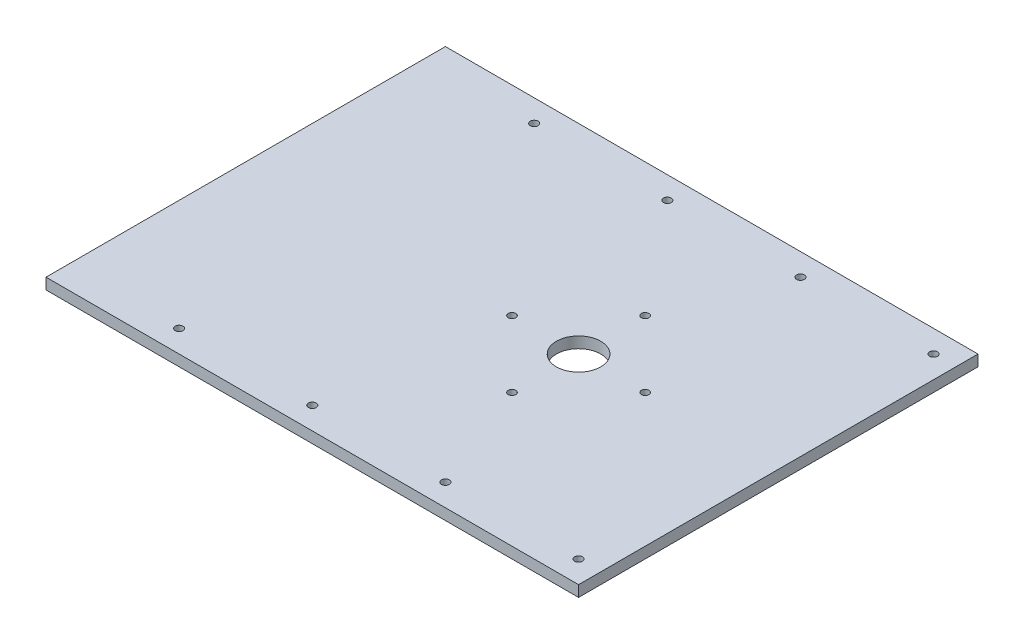
ISO-10303-21;
HEADER;
FILE_DESCRIPTION(('STEP AP214'),'2;1');
FILE_NAME('part.step','',(''),(''),'','','');
FILE_SCHEMA(('AUTOMOTIVE_DESIGN { 1 0 10303 214 1 1 1 1 }'));
ENDSEC;
DATA;
#1=APPLICATION_CONTEXT('core data for automotive mechanical design processes');
#2=APPLICATION_PROTOCOL_DEFINITION('international standard','automotive_design',2000,#1);
#3=PRODUCT_CONTEXT('',#1,'mechanical');
#4=PRODUCT('Part','Part','',(#3));
#5=PRODUCT_RELATED_PRODUCT_CATEGORY('part','',(#4));
#6=PRODUCT_DEFINITION_FORMATION('','',#4);
#7=PRODUCT_DEFINITION_CONTEXT('part definition',#1,'design');
#8=PRODUCT_DEFINITION('design','',#6,#7);
#9=PRODUCT_DEFINITION_SHAPE('','',#8);
#10=(LENGTH_UNIT() NAMED_UNIT(*) SI_UNIT(.MILLI.,.METRE.));
#11=(NAMED_UNIT(*) PLANE_ANGLE_UNIT() SI_UNIT($,.RADIAN.));
#12=(NAMED_UNIT(*) SI_UNIT($,.STERADIAN.) SOLID_ANGLE_UNIT());
#13=UNCERTAINTY_MEASURE_WITH_UNIT(LENGTH_MEASURE(1.E-05),#10,'distance_accuracy_value','');
#14=(GEOMETRIC_REPRESENTATION_CONTEXT(3) GLOBAL_UNCERTAINTY_ASSIGNED_CONTEXT((#13)) GLOBAL_UNIT_ASSIGNED_CONTEXT((#10,
#11,#12)) REPRESENTATION_CONTEXT('',''));
#15=CARTESIAN_POINT('',(0.,0.,0.));
#16=DIRECTION('',(0.,0.,1.));
#17=DIRECTION('',(1.,0.,0.));
#18=AXIS2_PLACEMENT_3D('',#15,#16,#17);
#19=CARTESIAN_POINT('',(0.,6.35,0.));
#20=DIRECTION('',(-1.,0.,0.));
#21=DIRECTION('',(0.,0.,1.));
#22=AXIS2_PLACEMENT_3D('',#19,#20,#21);
#23=PLANE('',#22);
#24=DIRECTION('',(0.,0.,-1.));
#25=VECTOR('',#24,1.);
#26=CARTESIAN_POINT('',(0.,0.,0.));
#27=LINE('',#26,#25);
#28=CARTESIAN_POINT('',(0.,0.,0.));
#29=VERTEX_POINT('',#28);
#30=CARTESIAN_POINT('',(0.,0.,-228.6));
#31=VERTEX_POINT('',#30);
#32=EDGE_CURVE('E100',#29,#31,#27,.T.);
#33=ORIENTED_EDGE('',*,*,#32,.T.);
#34=DIRECTION('',(0.,-1.,0.));
#35=VECTOR('',#34,1.);
#36=CARTESIAN_POINT('',(0.,6.35,-228.6));
#37=LINE('',#36,#35);
#38=CARTESIAN_POINT('',(0.,6.35,-228.6));
#39=VERTEX_POINT('',#38);
#40=EDGE_CURVE('E91',#39,#31,#37,.T.);
#41=ORIENTED_EDGE('',*,*,#40,.F.);
#42=DIRECTION('',(0.,0.,-1.));
#43=VECTOR('',#42,1.);
#44=CARTESIAN_POINT('',(0.,6.35,0.));
#45=LINE('',#44,#43);
#46=CARTESIAN_POINT('',(0.,6.35,0.));
#47=VERTEX_POINT('',#46);
#48=EDGE_CURVE('E85',#47,#39,#45,.T.);
#49=ORIENTED_EDGE('',*,*,#48,.F.);
#50=DIRECTION('',(0.,-1.,0.));
#51=VECTOR('',#50,1.);
#52=CARTESIAN_POINT('',(0.,6.35,0.));
#53=LINE('',#52,#51);
#54=EDGE_CURVE('E96',#47,#29,#53,.T.);
#55=ORIENTED_EDGE('',*,*,#54,.T.);
#56=EDGE_LOOP('',(#33,#41,#49,#55));
#57=FACE_BOUND('',#56,.T.);
#58=ADVANCED_FACE('F31',(#57),#23,.F.);
#59=CARTESIAN_POINT('',(0.,6.35,-228.6));
#60=DIRECTION('',(0.,0.,1.));
#61=DIRECTION('',(1.,0.,0.));
#62=AXIS2_PLACEMENT_3D('',#59,#60,#61);
#63=PLANE('',#62);
#64=DIRECTION('',(-1.,0.,0.));
#65=VECTOR('',#64,1.);
#66=CARTESIAN_POINT('',(0.,0.,-228.6));
#67=LINE('',#66,#65);
#68=CARTESIAN_POINT('',(-304.8,0.,-228.6));
#69=VERTEX_POINT('',#68);
#70=EDGE_CURVE('E90',#31,#69,#67,.T.);
#71=ORIENTED_EDGE('',*,*,#70,.T.);
#72=DIRECTION('',(0.,-1.,0.));
#73=VECTOR('',#72,1.);
#74=CARTESIAN_POINT('',(-304.8,6.35,-228.6));
#75=LINE('',#74,#73);
#76=CARTESIAN_POINT('',(-304.8,6.35,-228.6));
#77=VERTEX_POINT('',#76);
#78=EDGE_CURVE('E88',#77,#69,#75,.T.);
#79=ORIENTED_EDGE('',*,*,#78,.F.);
#80=DIRECTION('',(-1.,0.,0.));
#81=VECTOR('',#80,1.);
#82=CARTESIAN_POINT('',(0.,6.35,-228.6));
#83=LINE('',#82,#81);
#84=EDGE_CURVE('E79',#39,#77,#83,.T.);
#85=ORIENTED_EDGE('',*,*,#84,.F.);
#86=ORIENTED_EDGE('',*,*,#40,.T.);
#87=EDGE_LOOP('',(#71,#79,#85,#86));
#88=FACE_BOUND('',#87,.T.);
#89=ADVANCED_FACE('F89',(#88),#63,.F.);
#90=CARTESIAN_POINT('',(-304.8,6.35,0.));
#91=DIRECTION('',(1.,0.,0.));
#92=DIRECTION('',(0.,0.,-1.));
#93=AXIS2_PLACEMENT_3D('',#90,#91,#92);
#94=PLANE('',#93);
#95=DIRECTION('',(0.,0.,1.));
#96=VECTOR('',#95,1.);
#97=CARTESIAN_POINT('',(-304.8,0.,0.));
#98=LINE('',#97,#96);
#99=CARTESIAN_POINT('',(-304.8,0.,0.));
#100=VERTEX_POINT('',#99);
#101=EDGE_CURVE('E65',#69,#100,#98,.T.);
#102=ORIENTED_EDGE('',*,*,#101,.T.);
#103=DIRECTION('',(0.,-1.,0.));
#104=VECTOR('',#103,1.);
#105=CARTESIAN_POINT('',(-304.8,6.35,0.));
#106=LINE('',#105,#104);
#107=CARTESIAN_POINT('',(-304.8,6.35,0.));
#108=VERTEX_POINT('',#107);
#109=EDGE_CURVE('E92',#108,#100,#106,.T.);
#110=ORIENTED_EDGE('',*,*,#109,.F.);
#111=DIRECTION('',(0.,0.,1.));
#112=VECTOR('',#111,1.);
#113=CARTESIAN_POINT('',(-304.8,6.35,0.));
#114=LINE('',#113,#112);
#115=EDGE_CURVE('E83',#77,#108,#114,.T.);
#116=ORIENTED_EDGE('',*,*,#115,.F.);
#117=ORIENTED_EDGE('',*,*,#78,.T.);
#118=EDGE_LOOP('',(#102,#110,#116,#117));
#119=FACE_BOUND('',#118,.T.);
#120=ADVANCED_FACE('F94',(#119),#94,.F.);
#121=CARTESIAN_POINT('',(0.,6.35,0.));
#122=DIRECTION('',(0.,0.,-1.));
#123=DIRECTION('',(-1.,0.,0.));
#124=AXIS2_PLACEMENT_3D('',#121,#122,#123);
#125=PLANE('',#124);
#126=DIRECTION('',(1.,0.,0.));
#127=VECTOR('',#126,1.);
#128=CARTESIAN_POINT('',(0.,0.,0.));
#129=LINE('',#128,#127);
#130=EDGE_CURVE('E71',#100,#29,#129,.T.);
#131=ORIENTED_EDGE('',*,*,#130,.T.);
#132=ORIENTED_EDGE('',*,*,#54,.F.);
#133=DIRECTION('',(1.,0.,0.));
#134=VECTOR('',#133,1.);
#135=CARTESIAN_POINT('',(0.,6.35,0.));
#136=LINE('',#135,#134);
#137=EDGE_CURVE('E48',#108,#47,#136,.T.);
#138=ORIENTED_EDGE('',*,*,#137,.F.);
#139=ORIENTED_EDGE('',*,*,#109,.T.);
#140=EDGE_LOOP('',(#131,#132,#138,#139));
#141=FACE_BOUND('',#140,.T.);
#142=ADVANCED_FACE('F166',(#141),#125,.F.);
#143=CARTESIAN_POINT('',(0.,6.35,-228.6));
#144=DIRECTION('',(0.,1.,0.));
#145=DIRECTION('',(0.,0.,1.));
#146=AXIS2_PLACEMENT_3D('',#143,#144,#145);
#147=PLANE('',#146);
#148=CARTESIAN_POINT('',(-88.9,6.35,-215.9));
#149=DIRECTION('',(0.,-1.,0.));
#150=DIRECTION('',(0.,0.,-1.));
#151=AXIS2_PLACEMENT_3D('',#148,#149,#150);
#152=CIRCLE('',#151,2.2479);
#153=CARTESIAN_POINT('',(-88.9,6.35,-218.1479));
#154=VERTEX_POINT('',#153);
#155=EDGE_CURVE('E355',#154,#154,#152,.T.);
#156=ORIENTED_EDGE('',*,*,#155,.T.);
#157=EDGE_LOOP('',(#156));
#158=FACE_BOUND('',#157,.T.);
#159=CARTESIAN_POINT('',(-88.9,6.35,-12.7));
#160=DIRECTION('',(0.,-1.,0.));
#161=DIRECTION('',(0.,0.,-1.));
#162=AXIS2_PLACEMENT_3D('',#159,#160,#161);
#163=CIRCLE('',#162,2.2479);
#164=CARTESIAN_POINT('',(-88.9,6.35,-14.9479));
#165=VERTEX_POINT('',#164);
#166=EDGE_CURVE('E346',#165,#165,#163,.T.);
#167=ORIENTED_EDGE('',*,*,#166,.T.);
#168=EDGE_LOOP('',(#167));
#169=FACE_BOUND('',#168,.T.);
#170=CARTESIAN_POINT('',(-12.7,6.35,-12.7));
#171=DIRECTION('',(0.,-1.,0.));
#172=DIRECTION('',(0.,0.,-1.));
#173=AXIS2_PLACEMENT_3D('',#170,#171,#172);
#174=CIRCLE('',#173,2.2479);
#175=CARTESIAN_POINT('',(-12.7,6.35,-14.9479));
#176=VERTEX_POINT('',#175);
#177=EDGE_CURVE('E334',#176,#176,#174,.T.);
#178=ORIENTED_EDGE('',*,*,#177,.T.);
#179=EDGE_LOOP('',(#178));
#180=FACE_BOUND('',#179,.T.);
#181=CARTESIAN_POINT('',(-12.7,6.35,-215.9));
#182=DIRECTION('',(0.,-1.,0.));
#183=DIRECTION('',(0.,0.,-1.));
#184=AXIS2_PLACEMENT_3D('',#181,#182,#183);
#185=CIRCLE('',#184,2.2479);
#186=CARTESIAN_POINT('',(-12.7,6.35,-218.1479));
#187=VERTEX_POINT('',#186);
#188=EDGE_CURVE('E323',#187,#187,#185,.T.);
#189=ORIENTED_EDGE('',*,*,#188,.T.);
#190=EDGE_LOOP('',(#189));
#191=FACE_BOUND('',#190,.T.);
#192=CARTESIAN_POINT('',(-114.3,6.35,-114.3));
#193=DIRECTION('',(0.,1.,0.));
#194=DIRECTION('',(0.,0.,1.));
#195=AXIS2_PLACEMENT_3D('',#192,#193,#194);
#196=CIRCLE('',#195,12.7);
#197=CARTESIAN_POINT('',(-114.3,6.35,-101.6));
#198=VERTEX_POINT('',#197);
#199=EDGE_CURVE('E320',#198,#198,#196,.T.);
#200=ORIENTED_EDGE('',*,*,#199,.F.);
#201=EDGE_LOOP('',(#200));
#202=FACE_BOUND('',#201,.T.);
#203=CARTESIAN_POINT('',(-76.2,6.35,-114.3));
#204=DIRECTION('',(0.,-1.,0.));
#205=DIRECTION('',(0.,0.,-1.));
#206=AXIS2_PLACEMENT_3D('',#203,#204,#205);
#207=CIRCLE('',#206,2.15264999999999);
#208=CARTESIAN_POINT('',(-76.2,6.35,-116.45265));
#209=VERTEX_POINT('',#208);
#210=EDGE_CURVE('E310',#209,#209,#207,.T.);
#211=ORIENTED_EDGE('',*,*,#210,.T.);
#212=EDGE_LOOP('',(#211));
#213=FACE_BOUND('',#212,.T.);
#214=CARTESIAN_POINT('',(-114.3,6.35,-152.4));
#215=DIRECTION('',(0.,-1.,0.));
#216=DIRECTION('',(0.,0.,-1.));
#217=AXIS2_PLACEMENT_3D('',#214,#215,#216);
#218=CIRCLE('',#217,2.15264999999999);
#219=CARTESIAN_POINT('',(-114.3,6.35,-154.55265));
#220=VERTEX_POINT('',#219);
#221=EDGE_CURVE('E301',#220,#220,#218,.T.);
#222=ORIENTED_EDGE('',*,*,#221,.T.);
#223=EDGE_LOOP('',(#222));
#224=FACE_BOUND('',#223,.T.);
#225=CARTESIAN_POINT('',(-152.4,6.35,-114.3));
#226=DIRECTION('',(0.,-1.,0.));
#227=DIRECTION('',(0.,0.,-1.));
#228=AXIS2_PLACEMENT_3D('',#225,#226,#227);
#229=CIRCLE('',#228,2.15265000000001);
#230=CARTESIAN_POINT('',(-152.4,6.35,-116.45265));
#231=VERTEX_POINT('',#230);
#232=EDGE_CURVE('E284',#231,#231,#229,.T.);
#233=ORIENTED_EDGE('',*,*,#232,.T.);
#234=EDGE_LOOP('',(#233));
#235=FACE_BOUND('',#234,.T.);
#236=CARTESIAN_POINT('',(-114.3,6.35,-76.2));
#237=DIRECTION('',(0.,-1.,0.));
#238=DIRECTION('',(0.,0.,-1.));
#239=AXIS2_PLACEMENT_3D('',#236,#237,#238);
#240=CIRCLE('',#239,2.15264999999999);
#241=CARTESIAN_POINT('',(-114.3,6.35,-78.35265));
#242=VERTEX_POINT('',#241);
#243=EDGE_CURVE('E103',#242,#242,#240,.T.);
#244=ORIENTED_EDGE('',*,*,#243,.T.);
#245=EDGE_LOOP('',(#244));
#246=FACE_BOUND('',#245,.T.);
#247=ORIENTED_EDGE('',*,*,#48,.T.);
#248=ORIENTED_EDGE('',*,*,#84,.T.);
#249=ORIENTED_EDGE('',*,*,#115,.T.);
#250=ORIENTED_EDGE('',*,*,#137,.T.);
#251=EDGE_LOOP('',(#247,#248,#249,#250));
#252=FACE_BOUND('',#251,.T.);
#253=CARTESIAN_POINT('',(-165.1,6.35,-12.6999999999999));
#254=DIRECTION('',(0.,-1.,0.));
#255=DIRECTION('',(0.,0.,-1.));
#256=AXIS2_PLACEMENT_3D('',#253,#254,#255);
#257=CIRCLE('',#256,2.2479);
#258=CARTESIAN_POINT('',(-165.1,6.35,-14.9478999999999));
#259=VERTEX_POINT('',#258);
#260=EDGE_CURVE('E113',#259,#259,#257,.T.);
#261=ORIENTED_EDGE('',*,*,#260,.T.);
#262=EDGE_LOOP('',(#261));
#263=FACE_BOUND('',#262,.T.);
#264=CARTESIAN_POINT('',(-241.3,6.35,-12.6999999999999));
#265=DIRECTION('',(0.,-1.,0.));
#266=DIRECTION('',(0.,0.,-1.));
#267=AXIS2_PLACEMENT_3D('',#264,#265,#266);
#268=CIRCLE('',#267,2.2479);
#269=CARTESIAN_POINT('',(-241.3,6.35,-14.9478999999999));
#270=VERTEX_POINT('',#269);
#271=EDGE_CURVE('E122',#270,#270,#268,.T.);
#272=ORIENTED_EDGE('',*,*,#271,.T.);
#273=EDGE_LOOP('',(#272));
#274=FACE_BOUND('',#273,.T.);
#275=CARTESIAN_POINT('',(-165.1,6.35,-215.9));
#276=DIRECTION('',(0.,-1.,0.));
#277=DIRECTION('',(0.,0.,-1.));
#278=AXIS2_PLACEMENT_3D('',#275,#276,#277);
#279=CIRCLE('',#278,2.2479);
#280=CARTESIAN_POINT('',(-165.1,6.35,-218.1479));
#281=VERTEX_POINT('',#280);
#282=EDGE_CURVE('E131',#281,#281,#279,.T.);
#283=ORIENTED_EDGE('',*,*,#282,.T.);
#284=EDGE_LOOP('',(#283));
#285=FACE_BOUND('',#284,.T.);
#286=CARTESIAN_POINT('',(-241.3,6.35,-215.9));
#287=DIRECTION('',(0.,-1.,0.));
#288=DIRECTION('',(0.,0.,-1.));
#289=AXIS2_PLACEMENT_3D('',#286,#287,#288);
#290=CIRCLE('',#289,2.2479);
#291=CARTESIAN_POINT('',(-241.3,6.35,-218.1479));
#292=VERTEX_POINT('',#291);
#293=EDGE_CURVE('E40',#292,#292,#290,.T.);
#294=ORIENTED_EDGE('',*,*,#293,.T.);
#295=EDGE_LOOP('',(#294));
#296=FACE_BOUND('',#295,.T.);
#297=ADVANCED_FACE('F80',(#158,#169,#180,#191,#202,#213,#224,#235,#246,#252,#263,#274,#285,
#296),#147,.T.);
#298=CARTESIAN_POINT('',(0.,0.,-228.6));
#299=DIRECTION('',(0.,1.,0.));
#300=DIRECTION('',(0.,0.,1.));
#301=AXIS2_PLACEMENT_3D('',#298,#299,#300);
#302=PLANE('',#301);
#303=CARTESIAN_POINT('',(-88.9,0.,-215.9));
#304=DIRECTION('',(0.,-1.,0.));
#305=DIRECTION('',(0.,0.,-1.));
#306=AXIS2_PLACEMENT_3D('',#303,#304,#305);
#307=CIRCLE('',#306,4.2164);
#308=CARTESIAN_POINT('',(-88.9,0.,-220.1164));
#309=VERTEX_POINT('',#308);
#310=EDGE_CURVE('E358',#309,#309,#307,.T.);
#311=ORIENTED_EDGE('',*,*,#310,.F.);
#312=EDGE_LOOP('',(#311));
#313=FACE_BOUND('',#312,.T.);
#314=CARTESIAN_POINT('',(-88.9,0.,-12.7));
#315=DIRECTION('',(0.,-1.,0.));
#316=DIRECTION('',(0.,0.,-1.));
#317=AXIS2_PLACEMENT_3D('',#314,#315,#316);
#318=CIRCLE('',#317,4.2164);
#319=CARTESIAN_POINT('',(-88.9,0.,-16.9164));
#320=VERTEX_POINT('',#319);
#321=EDGE_CURVE('E349',#320,#320,#318,.T.);
#322=ORIENTED_EDGE('',*,*,#321,.F.);
#323=EDGE_LOOP('',(#322));
#324=FACE_BOUND('',#323,.T.);
#325=CARTESIAN_POINT('',(-12.7,0.,-12.7));
#326=DIRECTION('',(0.,-1.,0.));
#327=DIRECTION('',(0.,0.,-1.));
#328=AXIS2_PLACEMENT_3D('',#325,#326,#327);
#329=CIRCLE('',#328,4.2164);
#330=CARTESIAN_POINT('',(-12.7,0.,-16.9164));
#331=VERTEX_POINT('',#330);
#332=EDGE_CURVE('E340',#331,#331,#329,.T.);
#333=ORIENTED_EDGE('',*,*,#332,.F.);
#334=EDGE_LOOP('',(#333));
#335=FACE_BOUND('',#334,.T.);
#336=CARTESIAN_POINT('',(-12.7,0.,-215.9));
#337=DIRECTION('',(0.,-1.,0.));
#338=DIRECTION('',(0.,0.,-1.));
#339=AXIS2_PLACEMENT_3D('',#336,#337,#338);
#340=CIRCLE('',#339,4.2164);
#341=CARTESIAN_POINT('',(-12.7,0.,-220.1164));
#342=VERTEX_POINT('',#341);
#343=EDGE_CURVE('E331',#342,#342,#340,.T.);
#344=ORIENTED_EDGE('',*,*,#343,.F.);
#345=EDGE_LOOP('',(#344));
#346=FACE_BOUND('',#345,.T.);
#347=CARTESIAN_POINT('',(-114.3,0.,-114.3));
#348=DIRECTION('',(0.,1.,0.));
#349=DIRECTION('',(0.,0.,1.));
#350=AXIS2_PLACEMENT_3D('',#347,#348,#349);
#351=CIRCLE('',#350,12.7);
#352=CARTESIAN_POINT('',(-114.3,0.,-101.6));
#353=VERTEX_POINT('',#352);
#354=EDGE_CURVE('E319',#353,#353,#351,.T.);
#355=ORIENTED_EDGE('',*,*,#354,.T.);
#356=EDGE_LOOP('',(#355));
#357=FACE_BOUND('',#356,.T.);
#358=CARTESIAN_POINT('',(-76.2,0.,-114.3));
#359=DIRECTION('',(0.,-1.,0.));
#360=DIRECTION('',(0.,0.,-1.));
#361=AXIS2_PLACEMENT_3D('',#358,#359,#360);
#362=CIRCLE('',#361,4.21639999999999);
#363=CARTESIAN_POINT('',(-76.2,0.,-118.5164));
#364=VERTEX_POINT('',#363);
#365=EDGE_CURVE('E316',#364,#364,#362,.T.);
#366=ORIENTED_EDGE('',*,*,#365,.F.);
#367=EDGE_LOOP('',(#366));
#368=FACE_BOUND('',#367,.T.);
#369=CARTESIAN_POINT('',(-114.3,0.,-152.4));
#370=DIRECTION('',(0.,-1.,0.));
#371=DIRECTION('',(0.,0.,-1.));
#372=AXIS2_PLACEMENT_3D('',#369,#370,#371);
#373=CIRCLE('',#372,4.21639999999999);
#374=CARTESIAN_POINT('',(-114.3,0.,-156.6164));
#375=VERTEX_POINT('',#374);
#376=EDGE_CURVE('E307',#375,#375,#373,.T.);
#377=ORIENTED_EDGE('',*,*,#376,.F.);
#378=EDGE_LOOP('',(#377));
#379=FACE_BOUND('',#378,.T.);
#380=CARTESIAN_POINT('',(-152.4,0.,-114.3));
#381=DIRECTION('',(0.,-1.,0.));
#382=DIRECTION('',(0.,0.,-1.));
#383=AXIS2_PLACEMENT_3D('',#380,#381,#382);
#384=CIRCLE('',#383,4.21640000000001);
#385=CARTESIAN_POINT('',(-152.4,0.,-118.5164));
#386=VERTEX_POINT('',#385);
#387=EDGE_CURVE('E298',#386,#386,#384,.T.);
#388=ORIENTED_EDGE('',*,*,#387,.F.);
#389=EDGE_LOOP('',(#388));
#390=FACE_BOUND('',#389,.T.);
#391=CARTESIAN_POINT('',(-114.3,0.,-76.2));
#392=DIRECTION('',(0.,-1.,0.));
#393=DIRECTION('',(0.,0.,-1.));
#394=AXIS2_PLACEMENT_3D('',#391,#392,#393);
#395=CIRCLE('',#394,4.21639999999999);
#396=CARTESIAN_POINT('',(-114.3,0.,-80.4164));
#397=VERTEX_POINT('',#396);
#398=EDGE_CURVE('E282',#397,#397,#395,.T.);
#399=ORIENTED_EDGE('',*,*,#398,.F.);
#400=EDGE_LOOP('',(#399));
#401=FACE_BOUND('',#400,.T.);
#402=ORIENTED_EDGE('',*,*,#32,.F.);
#403=ORIENTED_EDGE('',*,*,#130,.F.);
#404=ORIENTED_EDGE('',*,*,#101,.F.);
#405=ORIENTED_EDGE('',*,*,#70,.F.);
#406=EDGE_LOOP('',(#402,#403,#404,#405));
#407=FACE_BOUND('',#406,.T.);
#408=CARTESIAN_POINT('',(-165.1,0.,-12.6999999999999));
#409=DIRECTION('',(0.,-1.,0.));
#410=DIRECTION('',(0.,0.,-1.));
#411=AXIS2_PLACEMENT_3D('',#408,#409,#410);
#412=CIRCLE('',#411,4.2164);
#413=CARTESIAN_POINT('',(-165.1,0.,-16.9163999999999));
#414=VERTEX_POINT('',#413);
#415=EDGE_CURVE('E110',#414,#414,#412,.T.);
#416=ORIENTED_EDGE('',*,*,#415,.F.);
#417=EDGE_LOOP('',(#416));
#418=FACE_BOUND('',#417,.T.);
#419=CARTESIAN_POINT('',(-241.3,0.,-12.6999999999999));
#420=DIRECTION('',(0.,-1.,0.));
#421=DIRECTION('',(0.,0.,-1.));
#422=AXIS2_PLACEMENT_3D('',#419,#420,#421);
#423=CIRCLE('',#422,4.2164);
#424=CARTESIAN_POINT('',(-241.3,0.,-16.9163999999999));
#425=VERTEX_POINT('',#424);
#426=EDGE_CURVE('E119',#425,#425,#423,.T.);
#427=ORIENTED_EDGE('',*,*,#426,.F.);
#428=EDGE_LOOP('',(#427));
#429=FACE_BOUND('',#428,.T.);
#430=CARTESIAN_POINT('',(-165.1,0.,-215.9));
#431=DIRECTION('',(0.,-1.,0.));
#432=DIRECTION('',(0.,0.,-1.));
#433=AXIS2_PLACEMENT_3D('',#430,#431,#432);
#434=CIRCLE('',#433,4.2164);
#435=CARTESIAN_POINT('',(-165.1,0.,-220.1164));
#436=VERTEX_POINT('',#435);
#437=EDGE_CURVE('E128',#436,#436,#434,.T.);
#438=ORIENTED_EDGE('',*,*,#437,.F.);
#439=EDGE_LOOP('',(#438));
#440=FACE_BOUND('',#439,.T.);
#441=CARTESIAN_POINT('',(-241.3,0.,-215.9));
#442=DIRECTION('',(0.,-1.,0.));
#443=DIRECTION('',(0.,0.,-1.));
#444=AXIS2_PLACEMENT_3D('',#441,#442,#443);
#445=CIRCLE('',#444,4.2164);
#446=CARTESIAN_POINT('',(-241.3,0.,-220.1164));
#447=VERTEX_POINT('',#446);
#448=EDGE_CURVE('E137',#447,#447,#445,.T.);
#449=ORIENTED_EDGE('',*,*,#448,.F.);
#450=EDGE_LOOP('',(#449));
#451=FACE_BOUND('',#450,.T.);
#452=ADVANCED_FACE('F153',(#313,#324,#335,#346,#357,#368,#379,#390,#401,#407,#418,#429,#440,
#451),#302,.F.);
#453=CARTESIAN_POINT('',(-114.3,0.,-76.2));
#454=DIRECTION('',(0.,-1.,0.));
#455=DIRECTION('',(0.,0.,-1.));
#456=AXIS2_PLACEMENT_3D('',#453,#454,#455);
#457=CYLINDRICAL_SURFACE('',#456,2.15264999999999);
#458=ORIENTED_EDGE('',*,*,#243,.F.);
#459=EDGE_LOOP('',(#458));
#460=FACE_BOUND('',#459,.T.);
#461=CARTESIAN_POINT('',(-114.3,1.7316918638421,-76.2));
#462=DIRECTION('',(0.,-1.,0.));
#463=DIRECTION('',(0.,0.,-1.));
#464=AXIS2_PLACEMENT_3D('',#461,#462,#463);
#465=CIRCLE('',#464,2.15264999999999);
#466=CARTESIAN_POINT('',(-114.3,1.7316918638421,-78.35265));
#467=VERTEX_POINT('',#466);
#468=EDGE_CURVE('E279',#467,#467,#465,.T.);
#469=ORIENTED_EDGE('',*,*,#468,.T.);
#470=EDGE_LOOP('',(#469));
#471=FACE_BOUND('',#470,.T.);
#472=ADVANCED_FACE('F155',(#460,#471),#457,.F.);
#473=CARTESIAN_POINT('',(-114.3,0.,-76.2));
#474=DIRECTION('',(0.,-1.,0.));
#475=DIRECTION('',(0.,0.,-1.));
#476=AXIS2_PLACEMENT_3D('',#473,#474,#475);
#477=CONICAL_SURFACE('',#476,4.21639999999999,0.872664625997168);
#478=ORIENTED_EDGE('',*,*,#468,.F.);
#479=EDGE_LOOP('',(#478));
#480=FACE_BOUND('',#479,.T.);
#481=ORIENTED_EDGE('',*,*,#398,.T.);
#482=EDGE_LOOP('',(#481));
#483=FACE_BOUND('',#482,.T.);
#484=ADVANCED_FACE('F163',(#480,#483),#477,.F.);
#485=CARTESIAN_POINT('',(-152.4,0.,-114.3));
#486=DIRECTION('',(0.,-1.,0.));
#487=DIRECTION('',(0.,0.,-1.));
#488=AXIS2_PLACEMENT_3D('',#485,#486,#487);
#489=CYLINDRICAL_SURFACE('',#488,2.15264999999999);
#490=ORIENTED_EDGE('',*,*,#232,.F.);
#491=EDGE_LOOP('',(#490));
#492=FACE_BOUND('',#491,.T.);
#493=CARTESIAN_POINT('',(-152.4,1.7316918638421,-114.3));
#494=DIRECTION('',(0.,-1.,0.));
#495=DIRECTION('',(0.,0.,-1.));
#496=AXIS2_PLACEMENT_3D('',#493,#494,#495);
#497=CIRCLE('',#496,2.15264999999998);
#498=CARTESIAN_POINT('',(-152.4,1.7316918638421,-116.45265));
#499=VERTEX_POINT('',#498);
#500=EDGE_CURVE('E288',#499,#499,#497,.T.);
#501=ORIENTED_EDGE('',*,*,#500,.T.);
#502=EDGE_LOOP('',(#501));
#503=FACE_BOUND('',#502,.T.);
#504=ADVANCED_FACE('F267',(#492,#503),#489,.F.);
#505=CARTESIAN_POINT('',(-152.4,0.,-114.3));
#506=DIRECTION('',(0.,-1.,0.));
#507=DIRECTION('',(0.,0.,-1.));
#508=AXIS2_PLACEMENT_3D('',#505,#506,#507);
#509=CONICAL_SURFACE('',#508,4.21640000000001,0.872664625997174);
#510=ORIENTED_EDGE('',*,*,#500,.F.);
#511=EDGE_LOOP('',(#510));
#512=FACE_BOUND('',#511,.T.);
#513=ORIENTED_EDGE('',*,*,#387,.T.);
#514=EDGE_LOOP('',(#513));
#515=FACE_BOUND('',#514,.T.);
#516=ADVANCED_FACE('F263',(#512,#515),#509,.F.);
#517=CARTESIAN_POINT('',(-114.3,0.,-152.4));
#518=DIRECTION('',(0.,-1.,0.));
#519=DIRECTION('',(0.,0.,-1.));
#520=AXIS2_PLACEMENT_3D('',#517,#518,#519);
#521=CYLINDRICAL_SURFACE('',#520,2.15264999999999);
#522=ORIENTED_EDGE('',*,*,#221,.F.);
#523=EDGE_LOOP('',(#522));
#524=FACE_BOUND('',#523,.T.);
#525=CARTESIAN_POINT('',(-114.3,1.7316918638421,-152.4));
#526=DIRECTION('',(0.,-1.,0.));
#527=DIRECTION('',(0.,0.,-1.));
#528=AXIS2_PLACEMENT_3D('',#525,#526,#527);
#529=CIRCLE('',#528,2.15264999999999);
#530=CARTESIAN_POINT('',(-114.3,1.7316918638421,-154.55265));
#531=VERTEX_POINT('',#530);
#532=EDGE_CURVE('E304',#531,#531,#529,.T.);
#533=ORIENTED_EDGE('',*,*,#532,.T.);
#534=EDGE_LOOP('',(#533));
#535=FACE_BOUND('',#534,.T.);
#536=ADVANCED_FACE('F259',(#524,#535),#521,.F.);
#537=CARTESIAN_POINT('',(-114.3,0.,-152.4));
#538=DIRECTION('',(0.,-1.,0.));
#539=DIRECTION('',(0.,0.,-1.));
#540=AXIS2_PLACEMENT_3D('',#537,#538,#539);
#541=CONICAL_SURFACE('',#540,4.21639999999999,0.872664625997168);
#542=ORIENTED_EDGE('',*,*,#532,.F.);
#543=EDGE_LOOP('',(#542));
#544=FACE_BOUND('',#543,.T.);
#545=ORIENTED_EDGE('',*,*,#376,.T.);
#546=EDGE_LOOP('',(#545));
#547=FACE_BOUND('',#546,.T.);
#548=ADVANCED_FACE('F255',(#544,#547),#541,.F.);
#549=CARTESIAN_POINT('',(-76.2,0.,-114.3));
#550=DIRECTION('',(0.,-1.,0.));
#551=DIRECTION('',(0.,0.,-1.));
#552=AXIS2_PLACEMENT_3D('',#549,#550,#551);
#553=CYLINDRICAL_SURFACE('',#552,2.15264999999999);
#554=ORIENTED_EDGE('',*,*,#210,.F.);
#555=EDGE_LOOP('',(#554));
#556=FACE_BOUND('',#555,.T.);
#557=CARTESIAN_POINT('',(-76.2,1.7316918638421,-114.3));
#558=DIRECTION('',(0.,-1.,0.));
#559=DIRECTION('',(0.,0.,-1.));
#560=AXIS2_PLACEMENT_3D('',#557,#558,#559);
#561=CIRCLE('',#560,2.15264999999999);
#562=CARTESIAN_POINT('',(-76.2,1.7316918638421,-116.45265));
#563=VERTEX_POINT('',#562);
#564=EDGE_CURVE('E313',#563,#563,#561,.T.);
#565=ORIENTED_EDGE('',*,*,#564,.T.);
#566=EDGE_LOOP('',(#565));
#567=FACE_BOUND('',#566,.T.);
#568=ADVANCED_FACE('F251',(#556,#567),#553,.F.);
#569=CARTESIAN_POINT('',(-76.2,0.,-114.3));
#570=DIRECTION('',(0.,-1.,0.));
#571=DIRECTION('',(0.,0.,-1.));
#572=AXIS2_PLACEMENT_3D('',#569,#570,#571);
#573=CONICAL_SURFACE('',#572,4.21639999999999,0.872664625997168);
#574=ORIENTED_EDGE('',*,*,#564,.F.);
#575=EDGE_LOOP('',(#574));
#576=FACE_BOUND('',#575,.T.);
#577=ORIENTED_EDGE('',*,*,#365,.T.);
#578=EDGE_LOOP('',(#577));
#579=FACE_BOUND('',#578,.T.);
#580=ADVANCED_FACE('F247',(#576,#579),#573,.F.);
#581=CARTESIAN_POINT('',(-114.3,0.,-114.3));
#582=DIRECTION('',(0.,1.,0.));
#583=DIRECTION('',(0.,0.,1.));
#584=AXIS2_PLACEMENT_3D('',#581,#582,#583);
#585=CYLINDRICAL_SURFACE('',#584,12.7);
#586=ORIENTED_EDGE('',*,*,#354,.F.);
#587=EDGE_LOOP('',(#586));
#588=FACE_BOUND('',#587,.T.);
#589=ORIENTED_EDGE('',*,*,#199,.T.);
#590=EDGE_LOOP('',(#589));
#591=FACE_BOUND('',#590,.T.);
#592=ADVANCED_FACE('F243',(#588,#591),#585,.F.);
#593=CARTESIAN_POINT('',(-12.7,0.,-215.9));
#594=DIRECTION('',(0.,-1.,0.));
#595=DIRECTION('',(0.,0.,-1.));
#596=AXIS2_PLACEMENT_3D('',#593,#594,#595);
#597=CYLINDRICAL_SURFACE('',#596,2.2479);
#598=ORIENTED_EDGE('',*,*,#188,.F.);
#599=EDGE_LOOP('',(#598));
#600=FACE_BOUND('',#599,.T.);
#601=CARTESIAN_POINT('',(-12.7,1.65176762397248,-215.9));
#602=DIRECTION('',(0.,-1.,0.));
#603=DIRECTION('',(0.,0.,-1.));
#604=AXIS2_PLACEMENT_3D('',#601,#602,#603);
#605=CIRCLE('',#604,2.2479);
#606=CARTESIAN_POINT('',(-12.7,1.65176762397248,-218.1479));
#607=VERTEX_POINT('',#606);
#608=EDGE_CURVE('E328',#607,#607,#605,.T.);
#609=ORIENTED_EDGE('',*,*,#608,.T.);
#610=EDGE_LOOP('',(#609));
#611=FACE_BOUND('',#610,.T.);
#612=ADVANCED_FACE('F239',(#600,#611),#597,.F.);
#613=CARTESIAN_POINT('',(-12.7,0.,-215.9));
#614=DIRECTION('',(0.,-1.,0.));
#615=DIRECTION('',(0.,0.,-1.));
#616=AXIS2_PLACEMENT_3D('',#613,#614,#615);
#617=CONICAL_SURFACE('',#616,4.2164,0.872664625997165);
#618=ORIENTED_EDGE('',*,*,#608,.F.);
#619=EDGE_LOOP('',(#618));
#620=FACE_BOUND('',#619,.T.);
#621=ORIENTED_EDGE('',*,*,#343,.T.);
#622=EDGE_LOOP('',(#621));
#623=FACE_BOUND('',#622,.T.);
#624=ADVANCED_FACE('F235',(#620,#623),#617,.F.);
#625=CARTESIAN_POINT('',(-12.7,0.,-12.7));
#626=DIRECTION('',(0.,-1.,0.));
#627=DIRECTION('',(0.,0.,-1.));
#628=AXIS2_PLACEMENT_3D('',#625,#626,#627);
#629=CYLINDRICAL_SURFACE('',#628,2.2479);
#630=ORIENTED_EDGE('',*,*,#177,.F.);
#631=EDGE_LOOP('',(#630));
#632=FACE_BOUND('',#631,.T.);
#633=CARTESIAN_POINT('',(-12.7,1.65176762397248,-12.7));
#634=DIRECTION('',(0.,-1.,0.));
#635=DIRECTION('',(0.,0.,-1.));
#636=AXIS2_PLACEMENT_3D('',#633,#634,#635);
#637=CIRCLE('',#636,2.2479);
#638=CARTESIAN_POINT('',(-12.7,1.65176762397248,-14.9479));
#639=VERTEX_POINT('',#638);
#640=EDGE_CURVE('E337',#639,#639,#637,.T.);
#641=ORIENTED_EDGE('',*,*,#640,.T.);
#642=EDGE_LOOP('',(#641));
#643=FACE_BOUND('',#642,.T.);
#644=ADVANCED_FACE('F231',(#632,#643),#629,.F.);
#645=CARTESIAN_POINT('',(-12.7,0.,-12.7));
#646=DIRECTION('',(0.,-1.,0.));
#647=DIRECTION('',(0.,0.,-1.));
#648=AXIS2_PLACEMENT_3D('',#645,#646,#647);
#649=CONICAL_SURFACE('',#648,4.2164,0.872664625997165);
#650=ORIENTED_EDGE('',*,*,#640,.F.);
#651=EDGE_LOOP('',(#650));
#652=FACE_BOUND('',#651,.T.);
#653=ORIENTED_EDGE('',*,*,#332,.T.);
#654=EDGE_LOOP('',(#653));
#655=FACE_BOUND('',#654,.T.);
#656=ADVANCED_FACE('F225',(#652,#655),#649,.F.);
#657=CARTESIAN_POINT('',(-88.9,0.,-12.7));
#658=DIRECTION('',(0.,-1.,0.));
#659=DIRECTION('',(0.,0.,-1.));
#660=AXIS2_PLACEMENT_3D('',#657,#658,#659);
#661=CYLINDRICAL_SURFACE('',#660,2.2479);
#662=ORIENTED_EDGE('',*,*,#166,.F.);
#663=EDGE_LOOP('',(#662));
#664=FACE_BOUND('',#663,.T.);
#665=CARTESIAN_POINT('',(-88.9,1.65176762397248,-12.7));
#666=DIRECTION('',(0.,-1.,0.));
#667=DIRECTION('',(0.,0.,-1.));
#668=AXIS2_PLACEMENT_3D('',#665,#666,#667);
#669=CIRCLE('',#668,2.2479);
#670=CARTESIAN_POINT('',(-88.9,1.65176762397248,-14.9479));
#671=VERTEX_POINT('',#670);
#672=EDGE_CURVE('E343',#671,#671,#669,.T.);
#673=ORIENTED_EDGE('',*,*,#672,.T.);
#674=EDGE_LOOP('',(#673));
#675=FACE_BOUND('',#674,.T.);
#676=ADVANCED_FACE('F191',(#664,#675),#661,.F.);
#677=CARTESIAN_POINT('',(-88.9,0.,-12.7));
#678=DIRECTION('',(0.,-1.,0.));
#679=DIRECTION('',(0.,0.,-1.));
#680=AXIS2_PLACEMENT_3D('',#677,#678,#679);
#681=CONICAL_SURFACE('',#680,4.2164,0.872664625997165);
#682=ORIENTED_EDGE('',*,*,#672,.F.);
#683=EDGE_LOOP('',(#682));
#684=FACE_BOUND('',#683,.T.);
#685=ORIENTED_EDGE('',*,*,#321,.T.);
#686=EDGE_LOOP('',(#685));
#687=FACE_BOUND('',#686,.T.);
#688=ADVANCED_FACE('F189',(#684,#687),#681,.F.);
#689=CARTESIAN_POINT('',(-165.1,0.,-12.6999999999999));
#690=DIRECTION('',(0.,-1.,0.));
#691=DIRECTION('',(0.,0.,-1.));
#692=AXIS2_PLACEMENT_3D('',#689,#690,#691);
#693=CONICAL_SURFACE('',#692,4.2164,0.872664625997165);
#694=CARTESIAN_POINT('',(-165.1,1.65176762397248,-12.6999999999999));
#695=DIRECTION('',(0.,-1.,0.));
#696=DIRECTION('',(0.,0.,-1.));
#697=AXIS2_PLACEMENT_3D('',#694,#695,#696);
#698=CIRCLE('',#697,2.2479);
#699=CARTESIAN_POINT('',(-165.1,1.65176762397248,-14.9478999999999));
#700=VERTEX_POINT('',#699);
#701=EDGE_CURVE('E116',#700,#700,#698,.T.);
#702=ORIENTED_EDGE('',*,*,#701,.F.);
#703=EDGE_LOOP('',(#702));
#704=FACE_BOUND('',#703,.T.);
#705=ORIENTED_EDGE('',*,*,#415,.T.);
#706=EDGE_LOOP('',(#705));
#707=FACE_BOUND('',#706,.T.);
#708=ADVANCED_FACE('F185',(#704,#707),#693,.F.);
#709=CARTESIAN_POINT('',(-165.1,0.,-12.6999999999999));
#710=DIRECTION('',(0.,-1.,0.));
#711=DIRECTION('',(0.,0.,-1.));
#712=AXIS2_PLACEMENT_3D('',#709,#710,#711);
#713=CYLINDRICAL_SURFACE('',#712,2.2479);
#714=ORIENTED_EDGE('',*,*,#260,.F.);
#715=EDGE_LOOP('',(#714));
#716=FACE_BOUND('',#715,.T.);
#717=ORIENTED_EDGE('',*,*,#701,.T.);
#718=EDGE_LOOP('',(#717));
#719=FACE_BOUND('',#718,.T.);
#720=ADVANCED_FACE('F181',(#716,#719),#713,.F.);
#721=CARTESIAN_POINT('',(-241.3,0.,-12.6999999999999));
#722=DIRECTION('',(0.,-1.,0.));
#723=DIRECTION('',(0.,0.,-1.));
#724=AXIS2_PLACEMENT_3D('',#721,#722,#723);
#725=CONICAL_SURFACE('',#724,4.2164,0.872664625997165);
#726=CARTESIAN_POINT('',(-241.3,1.65176762397248,-12.6999999999999));
#727=DIRECTION('',(0.,-1.,0.));
#728=DIRECTION('',(0.,0.,-1.));
#729=AXIS2_PLACEMENT_3D('',#726,#727,#728);
#730=CIRCLE('',#729,2.2479);
#731=CARTESIAN_POINT('',(-241.3,1.65176762397248,-14.9478999999999));
#732=VERTEX_POINT('',#731);
#733=EDGE_CURVE('E125',#732,#732,#730,.T.);
#734=ORIENTED_EDGE('',*,*,#733,.F.);
#735=EDGE_LOOP('',(#734));
#736=FACE_BOUND('',#735,.T.);
#737=ORIENTED_EDGE('',*,*,#426,.T.);
#738=EDGE_LOOP('',(#737));
#739=FACE_BOUND('',#738,.T.);
#740=ADVANCED_FACE('F184',(#736,#739),#725,.F.);
#741=CARTESIAN_POINT('',(-241.3,0.,-12.6999999999999));
#742=DIRECTION('',(0.,-1.,0.));
#743=DIRECTION('',(0.,0.,-1.));
#744=AXIS2_PLACEMENT_3D('',#741,#742,#743);
#745=CYLINDRICAL_SURFACE('',#744,2.2479);
#746=ORIENTED_EDGE('',*,*,#271,.F.);
#747=EDGE_LOOP('',(#746));
#748=FACE_BOUND('',#747,.T.);
#749=ORIENTED_EDGE('',*,*,#733,.T.);
#750=EDGE_LOOP('',(#749));
#751=FACE_BOUND('',#750,.T.);
#752=ADVANCED_FACE('F192',(#748,#751),#745,.F.);
#753=CARTESIAN_POINT('',(-88.9,0.,-215.9));
#754=DIRECTION('',(0.,-1.,0.));
#755=DIRECTION('',(0.,0.,-1.));
#756=AXIS2_PLACEMENT_3D('',#753,#754,#755);
#757=CYLINDRICAL_SURFACE('',#756,2.2479);
#758=ORIENTED_EDGE('',*,*,#155,.F.);
#759=EDGE_LOOP('',(#758));
#760=FACE_BOUND('',#759,.T.);
#761=CARTESIAN_POINT('',(-88.9,1.65176762397248,-215.9));
#762=DIRECTION('',(0.,-1.,0.));
#763=DIRECTION('',(0.,0.,-1.));
#764=AXIS2_PLACEMENT_3D('',#761,#762,#763);
#765=CIRCLE('',#764,2.2479);
#766=CARTESIAN_POINT('',(-88.9,1.65176762397248,-218.1479));
#767=VERTEX_POINT('',#766);
#768=EDGE_CURVE('E352',#767,#767,#765,.T.);
#769=ORIENTED_EDGE('',*,*,#768,.T.);
#770=EDGE_LOOP('',(#769));
#771=FACE_BOUND('',#770,.T.);
#772=ADVANCED_FACE('F195',(#760,#771),#757,.F.);
#773=CARTESIAN_POINT('',(-88.9,0.,-215.9));
#774=DIRECTION('',(0.,-1.,0.));
#775=DIRECTION('',(0.,0.,-1.));
#776=AXIS2_PLACEMENT_3D('',#773,#774,#775);
#777=CONICAL_SURFACE('',#776,4.2164,0.872664625997165);
#778=ORIENTED_EDGE('',*,*,#768,.F.);
#779=EDGE_LOOP('',(#778));
#780=FACE_BOUND('',#779,.T.);
#781=ORIENTED_EDGE('',*,*,#310,.T.);
#782=EDGE_LOOP('',(#781));
#783=FACE_BOUND('',#782,.T.);
#784=ADVANCED_FACE('F197',(#780,#783),#777,.F.);
#785=CARTESIAN_POINT('',(-165.1,0.,-215.9));
#786=DIRECTION('',(0.,-1.,0.));
#787=DIRECTION('',(0.,0.,-1.));
#788=AXIS2_PLACEMENT_3D('',#785,#786,#787);
#789=CONICAL_SURFACE('',#788,4.2164,0.872664625997165);
#790=CARTESIAN_POINT('',(-165.1,1.65176762397248,-215.9));
#791=DIRECTION('',(0.,-1.,0.));
#792=DIRECTION('',(0.,0.,-1.));
#793=AXIS2_PLACEMENT_3D('',#790,#791,#792);
#794=CIRCLE('',#793,2.2479);
#795=CARTESIAN_POINT('',(-165.1,1.65176762397248,-218.1479));
#796=VERTEX_POINT('',#795);
#797=EDGE_CURVE('E134',#796,#796,#794,.T.);
#798=ORIENTED_EDGE('',*,*,#797,.F.);
#799=EDGE_LOOP('',(#798));
#800=FACE_BOUND('',#799,.T.);
#801=ORIENTED_EDGE('',*,*,#437,.T.);
#802=EDGE_LOOP('',(#801));
#803=FACE_BOUND('',#802,.T.);
#804=ADVANCED_FACE('F203',(#800,#803),#789,.F.);
#805=CARTESIAN_POINT('',(-165.1,0.,-215.9));
#806=DIRECTION('',(0.,-1.,0.));
#807=DIRECTION('',(0.,0.,-1.));
#808=AXIS2_PLACEMENT_3D('',#805,#806,#807);
#809=CYLINDRICAL_SURFACE('',#808,2.2479);
#810=ORIENTED_EDGE('',*,*,#282,.F.);
#811=EDGE_LOOP('',(#810));
#812=FACE_BOUND('',#811,.T.);
#813=ORIENTED_EDGE('',*,*,#797,.T.);
#814=EDGE_LOOP('',(#813));
#815=FACE_BOUND('',#814,.T.);
#816=ADVANCED_FACE('F150',(#812,#815),#809,.F.);
#817=CARTESIAN_POINT('',(-241.3,0.,-215.9));
#818=DIRECTION('',(0.,-1.,0.));
#819=DIRECTION('',(0.,0.,-1.));
#820=AXIS2_PLACEMENT_3D('',#817,#818,#819);
#821=CONICAL_SURFACE('',#820,4.2164,0.872664625997165);
#822=CARTESIAN_POINT('',(-241.3,1.65176762397248,-215.9));
#823=DIRECTION('',(0.,-1.,0.));
#824=DIRECTION('',(0.,0.,-1.));
#825=AXIS2_PLACEMENT_3D('',#822,#823,#824);
#826=CIRCLE('',#825,2.2479);
#827=CARTESIAN_POINT('',(-241.3,1.65176762397248,-218.1479));
#828=VERTEX_POINT('',#827);
#829=EDGE_CURVE('E11',#828,#828,#826,.T.);
#830=ORIENTED_EDGE('',*,*,#829,.F.);
#831=EDGE_LOOP('',(#830));
#832=FACE_BOUND('',#831,.T.);
#833=ORIENTED_EDGE('',*,*,#448,.T.);
#834=EDGE_LOOP('',(#833));
#835=FACE_BOUND('',#834,.T.);
#836=ADVANCED_FACE('F33',(#832,#835),#821,.F.);
#837=CARTESIAN_POINT('',(-241.3,0.,-215.9));
#838=DIRECTION('',(0.,-1.,0.));
#839=DIRECTION('',(0.,0.,-1.));
#840=AXIS2_PLACEMENT_3D('',#837,#838,#839);
#841=CYLINDRICAL_SURFACE('',#840,2.2479);
#842=ORIENTED_EDGE('',*,*,#293,.F.);
#843=EDGE_LOOP('',(#842));
#844=FACE_BOUND('',#843,.T.);
#845=ORIENTED_EDGE('',*,*,#829,.T.);
#846=EDGE_LOOP('',(#845));
#847=FACE_BOUND('',#846,.T.);
#848=ADVANCED_FACE('F143',(#844,#847),#841,.F.);
#849=CLOSED_SHELL('',(#58,#89,#120,#142,#297,#452,#472,#484,#504,#516,#536,#548,#568,#580,#592,
#612,#624,#644,#656,#676,#688,#708,#720,#740,#752,#772,#784,#804,#816,#836,#848));
#850=MANIFOLD_SOLID_BREP('B2',#849);
#851=ADVANCED_BREP_SHAPE_REPRESENTATION('',(#18,#850),#14);
#852=SHAPE_DEFINITION_REPRESENTATION(#9,#851);
ENDSEC;
END-ISO-10303-21;
